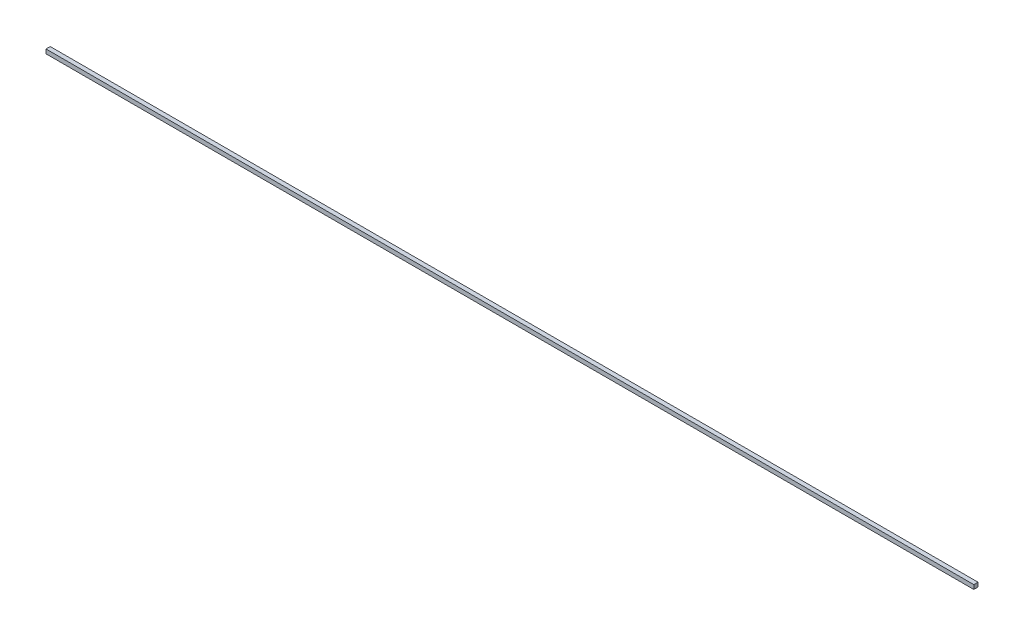
ISO-10303-21;
HEADER;
FILE_DESCRIPTION(('STEP AP214'),'2;1');
FILE_NAME('part.step','',(''),(''),'','','');
FILE_SCHEMA(('AUTOMOTIVE_DESIGN { 1 0 10303 214 1 1 1 1 }'));
ENDSEC;
DATA;
#1=APPLICATION_CONTEXT('core data for automotive mechanical design processes');
#2=APPLICATION_PROTOCOL_DEFINITION('international standard','automotive_design',2000,#1);
#3=PRODUCT_CONTEXT('',#1,'mechanical');
#4=PRODUCT('Part','Part','',(#3));
#5=PRODUCT_RELATED_PRODUCT_CATEGORY('part','',(#4));
#6=PRODUCT_DEFINITION_FORMATION('','',#4);
#7=PRODUCT_DEFINITION_CONTEXT('part definition',#1,'design');
#8=PRODUCT_DEFINITION('design','',#6,#7);
#9=PRODUCT_DEFINITION_SHAPE('','',#8);
#10=(LENGTH_UNIT() NAMED_UNIT(*) SI_UNIT(.MILLI.,.METRE.));
#11=(NAMED_UNIT(*) PLANE_ANGLE_UNIT() SI_UNIT($,.RADIAN.));
#12=(NAMED_UNIT(*) SI_UNIT($,.STERADIAN.) SOLID_ANGLE_UNIT());
#13=UNCERTAINTY_MEASURE_WITH_UNIT(LENGTH_MEASURE(1.E-05),#10,'distance_accuracy_value','');
#14=(GEOMETRIC_REPRESENTATION_CONTEXT(3) GLOBAL_UNCERTAINTY_ASSIGNED_CONTEXT((#13)) GLOBAL_UNIT_ASSIGNED_CONTEXT((#10,
#11,#12)) REPRESENTATION_CONTEXT('',''));
#15=CARTESIAN_POINT('',(0.,0.,0.));
#16=DIRECTION('',(0.,0.,1.));
#17=DIRECTION('',(1.,0.,0.));
#18=AXIS2_PLACEMENT_3D('',#15,#16,#17);
#19=CARTESIAN_POINT('',(597.266258042068,0.,0.));
#20=DIRECTION('',(-1.,0.,0.));
#21=DIRECTION('',(0.,0.,1.));
#22=AXIS2_PLACEMENT_3D('',#19,#20,#21);
#23=PLANE('',#22);
#24=DIRECTION('',(0.,0.,-1.));
#25=VECTOR('',#24,1.);
#26=CARTESIAN_POINT('',(597.266258042068,50.,80.));
#27=LINE('',#26,#25);
#28=CARTESIAN_POINT('',(597.266258042068,50.,5.));
#29=VERTEX_POINT('',#28);
#30=CARTESIAN_POINT('',(597.266258042068,50.,0.));
#31=VERTEX_POINT('',#30);
#32=EDGE_CURVE('E82',#29,#31,#27,.T.);
#33=ORIENTED_EDGE('',*,*,#32,.F.);
#34=DIRECTION('',(0.,-1.,0.));
#35=VECTOR('',#34,1.);
#36=CARTESIAN_POINT('',(597.266258042068,-45.,5.));
#37=LINE('',#36,#35);
#38=CARTESIAN_POINT('',(597.266258042068,45.,5.));
#39=VERTEX_POINT('',#38);
#40=EDGE_CURVE('E11',#29,#39,#37,.T.);
#41=ORIENTED_EDGE('',*,*,#40,.T.);
#42=DIRECTION('',(0.,0.,-1.));
#43=VECTOR('',#42,1.);
#44=CARTESIAN_POINT('',(597.266258042068,45.,0.));
#45=LINE('',#44,#43);
#46=CARTESIAN_POINT('',(597.266258042068,45.,0.));
#47=VERTEX_POINT('',#46);
#48=EDGE_CURVE('E42',#39,#47,#45,.T.);
#49=ORIENTED_EDGE('',*,*,#48,.T.);
#50=DIRECTION('',(0.,-1.,0.));
#51=VECTOR('',#50,1.);
#52=CARTESIAN_POINT('',(597.266258042068,0.,0.));
#53=LINE('',#52,#51);
#54=EDGE_CURVE('E37',#31,#47,#53,.T.);
#55=ORIENTED_EDGE('',*,*,#54,.F.);
#56=EDGE_LOOP('',(#33,#41,#49,#55));
#57=FACE_BOUND('',#56,.T.);
#58=ADVANCED_FACE('F34',(#57),#23,.F.);
#59=CARTESIAN_POINT('',(-502.733741957931,0.,0.));
#60=DIRECTION('',(1.,0.,0.));
#61=DIRECTION('',(0.,0.,-1.));
#62=AXIS2_PLACEMENT_3D('',#59,#60,#61);
#63=PLANE('',#62);
#64=DIRECTION('',(0.,0.,1.));
#65=VECTOR('',#64,1.);
#66=CARTESIAN_POINT('',(-502.733741957931,45.,0.));
#67=LINE('',#66,#65);
#68=CARTESIAN_POINT('',(-502.733741957931,45.,0.));
#69=VERTEX_POINT('',#68);
#70=CARTESIAN_POINT('',(-502.733741957931,45.,5.));
#71=VERTEX_POINT('',#70);
#72=EDGE_CURVE('E101',#69,#71,#67,.T.);
#73=ORIENTED_EDGE('',*,*,#72,.T.);
#74=DIRECTION('',(0.,1.,0.));
#75=VECTOR('',#74,1.);
#76=CARTESIAN_POINT('',(-502.733741957931,-45.,5.));
#77=LINE('',#76,#75);
#78=CARTESIAN_POINT('',(-502.733741957931,50.,5.));
#79=VERTEX_POINT('',#78);
#80=EDGE_CURVE('E97',#71,#79,#77,.T.);
#81=ORIENTED_EDGE('',*,*,#80,.T.);
#82=DIRECTION('',(0.,0.,-1.));
#83=VECTOR('',#82,1.);
#84=CARTESIAN_POINT('',(-502.733741957931,50.,80.));
#85=LINE('',#84,#83);
#86=CARTESIAN_POINT('',(-502.733741957931,50.,0.));
#87=VERTEX_POINT('',#86);
#88=EDGE_CURVE('E90',#79,#87,#85,.T.);
#89=ORIENTED_EDGE('',*,*,#88,.T.);
#90=DIRECTION('',(0.,1.,0.));
#91=VECTOR('',#90,1.);
#92=CARTESIAN_POINT('',(-502.733741957931,0.,0.));
#93=LINE('',#92,#91);
#94=EDGE_CURVE('E85',#69,#87,#93,.T.);
#95=ORIENTED_EDGE('',*,*,#94,.F.);
#96=EDGE_LOOP('',(#73,#81,#89,#95));
#97=FACE_BOUND('',#96,.T.);
#98=ADVANCED_FACE('F108',(#97),#63,.F.);
#99=CARTESIAN_POINT('',(0.,45.,0.));
#100=DIRECTION('',(0.,-1.,0.));
#101=DIRECTION('',(0.,0.,-1.));
#102=AXIS2_PLACEMENT_3D('',#99,#100,#101);
#103=PLANE('',#102);
#104=ORIENTED_EDGE('',*,*,#48,.F.);
#105=DIRECTION('',(1.,0.,0.));
#106=VECTOR('',#105,1.);
#107=CARTESIAN_POINT('',(597.266258042068,45.,5.));
#108=LINE('',#107,#106);
#109=EDGE_CURVE('E79',#71,#39,#108,.T.);
#110=ORIENTED_EDGE('',*,*,#109,.F.);
#111=ORIENTED_EDGE('',*,*,#72,.F.);
#112=DIRECTION('',(1.,0.,0.));
#113=VECTOR('',#112,1.);
#114=CARTESIAN_POINT('',(-502.733741957931,45.,0.));
#115=LINE('',#114,#113);
#116=EDGE_CURVE('E94',#69,#47,#115,.T.);
#117=ORIENTED_EDGE('',*,*,#116,.T.);
#118=EDGE_LOOP('',(#104,#110,#111,#117));
#119=FACE_BOUND('',#118,.T.);
#120=ADVANCED_FACE('F105',(#119),#103,.T.);
#121=CARTESIAN_POINT('',(-502.733741957931,0.,0.));
#122=DIRECTION('',(0.,0.,1.));
#123=DIRECTION('',(1.,0.,0.));
#124=AXIS2_PLACEMENT_3D('',#121,#122,#123);
#125=PLANE('',#124);
#126=DIRECTION('',(-1.,0.,0.));
#127=VECTOR('',#126,1.);
#128=CARTESIAN_POINT('',(-502.733741957931,50.,0.));
#129=LINE('',#128,#127);
#130=EDGE_CURVE('E86',#31,#87,#129,.T.);
#131=ORIENTED_EDGE('',*,*,#130,.F.);
#132=ORIENTED_EDGE('',*,*,#54,.T.);
#133=ORIENTED_EDGE('',*,*,#116,.F.);
#134=ORIENTED_EDGE('',*,*,#94,.T.);
#135=EDGE_LOOP('',(#131,#132,#133,#134));
#136=FACE_BOUND('',#135,.T.);
#137=ADVANCED_FACE('F106',(#136),#125,.F.);
#138=CARTESIAN_POINT('',(-502.733741957931,50.,80.));
#139=DIRECTION('',(0.,-1.,0.));
#140=DIRECTION('',(0.,0.,-1.));
#141=AXIS2_PLACEMENT_3D('',#138,#139,#140);
#142=PLANE('',#141);
#143=ORIENTED_EDGE('',*,*,#88,.F.);
#144=DIRECTION('',(1.,0.,0.));
#145=VECTOR('',#144,1.);
#146=CARTESIAN_POINT('',(-502.733741957931,50.,5.));
#147=LINE('',#146,#145);
#148=EDGE_CURVE('E78',#79,#29,#147,.T.);
#149=ORIENTED_EDGE('',*,*,#148,.T.);
#150=ORIENTED_EDGE('',*,*,#32,.T.);
#151=ORIENTED_EDGE('',*,*,#130,.T.);
#152=EDGE_LOOP('',(#143,#149,#150,#151));
#153=FACE_BOUND('',#152,.T.);
#154=ADVANCED_FACE('F88',(#153),#142,.F.);
#155=CARTESIAN_POINT('',(597.266258042068,-45.,5.));
#156=DIRECTION('',(0.,0.,1.));
#157=DIRECTION('',(1.,0.,0.));
#158=AXIS2_PLACEMENT_3D('',#155,#156,#157);
#159=PLANE('',#158);
#160=ORIENTED_EDGE('',*,*,#40,.F.);
#161=ORIENTED_EDGE('',*,*,#148,.F.);
#162=ORIENTED_EDGE('',*,*,#80,.F.);
#163=ORIENTED_EDGE('',*,*,#109,.T.);
#164=EDGE_LOOP('',(#160,#161,#162,#163));
#165=FACE_BOUND('',#164,.T.);
#166=ADVANCED_FACE('F76',(#165),#159,.T.);
#167=CLOSED_SHELL('',(#58,#98,#120,#137,#154,#166));
#168=MANIFOLD_SOLID_BREP('B2',#167);
#169=ADVANCED_BREP_SHAPE_REPRESENTATION('',(#18,#168),#14);
#170=SHAPE_DEFINITION_REPRESENTATION(#9,#169);
ENDSEC;
END-ISO-10303-21;
